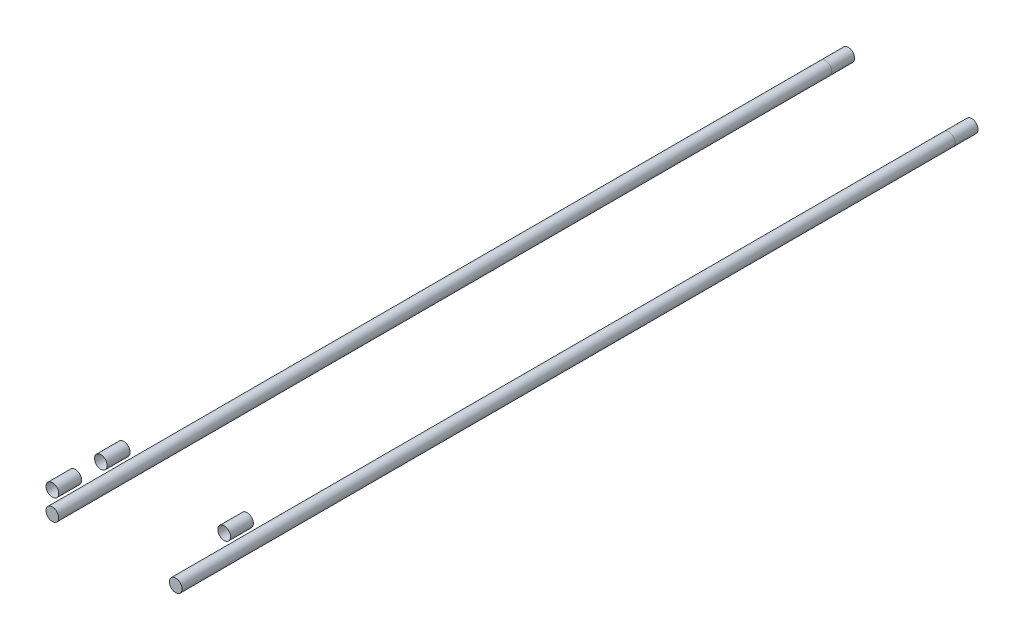
ISO-10303-21;
HEADER;
FILE_DESCRIPTION(('STEP AP214'),'2;1');
FILE_NAME('part.step','',(''),(''),'','','');
FILE_SCHEMA(('AUTOMOTIVE_DESIGN { 1 0 10303 214 1 1 1 1 }'));
ENDSEC;
DATA;
#1=APPLICATION_CONTEXT('core data for automotive mechanical design processes');
#2=APPLICATION_PROTOCOL_DEFINITION('international standard','automotive_design',2000,#1);
#3=PRODUCT_CONTEXT('',#1,'mechanical');
#4=PRODUCT('Part','Part','',(#3));
#5=PRODUCT_RELATED_PRODUCT_CATEGORY('part','',(#4));
#6=PRODUCT_DEFINITION_FORMATION('','',#4);
#7=PRODUCT_DEFINITION_CONTEXT('part definition',#1,'design');
#8=PRODUCT_DEFINITION('design','',#6,#7);
#9=PRODUCT_DEFINITION_SHAPE('','',#8);
#10=(LENGTH_UNIT() NAMED_UNIT(*) SI_UNIT(.MILLI.,.METRE.));
#11=(NAMED_UNIT(*) PLANE_ANGLE_UNIT() SI_UNIT($,.RADIAN.));
#12=(NAMED_UNIT(*) SI_UNIT($,.STERADIAN.) SOLID_ANGLE_UNIT());
#13=UNCERTAINTY_MEASURE_WITH_UNIT(LENGTH_MEASURE(1.E-05),#10,'distance_accuracy_value','');
#14=(GEOMETRIC_REPRESENTATION_CONTEXT(3) GLOBAL_UNCERTAINTY_ASSIGNED_CONTEXT((#13)) GLOBAL_UNIT_ASSIGNED_CONTEXT((#10,
#11,#12)) REPRESENTATION_CONTEXT('',''));
#15=CARTESIAN_POINT('',(0.,0.,0.));
#16=DIRECTION('',(0.,0.,1.));
#17=DIRECTION('',(1.,0.,0.));
#18=AXIS2_PLACEMENT_3D('',#15,#16,#17);
#19=CARTESIAN_POINT('',(86.868,-20.93468,66.2586122421384));
#20=DIRECTION('',(0.,0.,-1.));
#21=DIRECTION('',(-1.,0.,0.));
#22=AXIS2_PLACEMENT_3D('',#19,#20,#21);
#23=CYLINDRICAL_SURFACE('',#22,6.35);
#24=CARTESIAN_POINT('',(86.868,-20.93468,-722.376));
#25=DIRECTION('',(0.,0.,1.));
#26=DIRECTION('',(1.,0.,0.));
#27=AXIS2_PLACEMENT_3D('',#24,#25,#26);
#28=CIRCLE('',#27,6.35);
#29=CARTESIAN_POINT('',(80.518,-20.93468,-722.376));
#30=VERTEX_POINT('',#29);
#31=EDGE_CURVE('E51',#30,#30,#28,.T.);
#32=CARTESIAN_POINT('',(86.868,-20.93468,48.2981000000001));
#33=DIRECTION('',(0.,0.,1.));
#34=DIRECTION('',(1.,0.,0.));
#35=AXIS2_PLACEMENT_3D('',#32,#33,#34);
#36=CIRCLE('',#35,6.35);
#37=CARTESIAN_POINT('',(80.518,-20.93468,48.2981000000001));
#38=VERTEX_POINT('',#37);
#39=EDGE_CURVE('E11',#38,#38,#36,.T.);
#40=CARTESIAN_POINT('',(80.518,-20.93468,-722.376));
#41=CARTESIAN_POINT('',(80.518,-20.93468,-714.348144791667));
#42=CARTESIAN_POINT('',(80.518,-20.93468,-706.320289583333));
#43=CARTESIAN_POINT('',(80.518,-20.93468,-690.264579166667));
#44=CARTESIAN_POINT('',(80.518,-20.93468,-682.236723958333));
#45=CARTESIAN_POINT('',(80.518,-20.93468,-666.181013541667));
#46=CARTESIAN_POINT('',(80.518,-20.93468,-658.153158333333));
#47=CARTESIAN_POINT('',(80.518,-20.93468,-642.097447916667));
#48=CARTESIAN_POINT('',(80.518,-20.93468,-634.069592708333));
#49=CARTESIAN_POINT('',(80.518,-20.93468,-618.013882291667));
#50=CARTESIAN_POINT('',(80.518,-20.93468,-609.986027083333));
#51=CARTESIAN_POINT('',(80.518,-20.93468,-593.930316666666));
#52=CARTESIAN_POINT('',(80.518,-20.93468,-585.902461458333));
#53=CARTESIAN_POINT('',(80.518,-20.93468,-569.846751041666));
#54=CARTESIAN_POINT('',(80.518,-20.93468,-561.818895833333));
#55=CARTESIAN_POINT('',(80.518,-20.93468,-545.763185416667));
#56=CARTESIAN_POINT('',(80.518,-20.93468,-537.735330208333));
#57=CARTESIAN_POINT('',(80.518,-20.93468,-521.679619791667));
#58=CARTESIAN_POINT('',(80.518,-20.93468,-513.651764583333));
#59=CARTESIAN_POINT('',(80.518,-20.93468,-497.596054166667));
#60=CARTESIAN_POINT('',(80.518,-20.93468,-489.568198958333));
#61=CARTESIAN_POINT('',(80.518,-20.93468,-473.512488541667));
#62=CARTESIAN_POINT('',(80.518,-20.93468,-465.484633333333));
#63=CARTESIAN_POINT('',(80.518,-20.93468,-449.428922916667));
#64=CARTESIAN_POINT('',(80.518,-20.93468,-441.401067708333));
#65=CARTESIAN_POINT('',(80.518,-20.93468,-425.345357291667));
#66=CARTESIAN_POINT('',(80.518,-20.93468,-417.317502083333));
#67=CARTESIAN_POINT('',(80.518,-20.93468,-401.261791666667));
#68=CARTESIAN_POINT('',(80.518,-20.93468,-393.233936458333));
#69=CARTESIAN_POINT('',(80.518,-20.93468,-377.178226041667));
#70=CARTESIAN_POINT('',(80.518,-20.93468,-369.150370833333));
#71=CARTESIAN_POINT('',(80.518,-20.93468,-353.094660416667));
#72=CARTESIAN_POINT('',(80.518,-20.93468,-345.066805208333));
#73=CARTESIAN_POINT('',(80.518,-20.93468,-329.011094791667));
#74=CARTESIAN_POINT('',(80.518,-20.93468,-320.983239583333));
#75=CARTESIAN_POINT('',(80.518,-20.93468,-304.927529166667));
#76=CARTESIAN_POINT('',(80.518,-20.93468,-296.899673958333));
#77=CARTESIAN_POINT('',(80.518,-20.93468,-280.843963541667));
#78=CARTESIAN_POINT('',(80.518,-20.93468,-272.816108333333));
#79=CARTESIAN_POINT('',(80.518,-20.93468,-256.760397916667));
#80=CARTESIAN_POINT('',(80.518,-20.93468,-248.732542708333));
#81=CARTESIAN_POINT('',(80.518,-20.93468,-232.676832291667));
#82=CARTESIAN_POINT('',(80.518,-20.93468,-224.648977083333));
#83=CARTESIAN_POINT('',(80.518,-20.93468,-208.593266666667));
#84=CARTESIAN_POINT('',(80.518,-20.93468,-200.565411458333));
#85=CARTESIAN_POINT('',(80.518,-20.93468,-184.509701041667));
#86=CARTESIAN_POINT('',(80.518,-20.93468,-176.481845833333));
#87=CARTESIAN_POINT('',(80.518,-20.93468,-160.426135416667));
#88=CARTESIAN_POINT('',(80.518,-20.93468,-152.398280208333));
#89=CARTESIAN_POINT('',(80.518,-20.93468,-136.342569791667));
#90=CARTESIAN_POINT('',(80.518,-20.93468,-128.314714583333));
#91=CARTESIAN_POINT('',(80.518,-20.93468,-112.259004166667));
#92=CARTESIAN_POINT('',(80.518,-20.93468,-104.231148958333));
#93=CARTESIAN_POINT('',(80.518,-20.93468,-88.1754385416666));
#94=CARTESIAN_POINT('',(80.518,-20.93468,-80.1475833333332));
#95=CARTESIAN_POINT('',(80.518,-20.93468,-64.0918729166665));
#96=CARTESIAN_POINT('',(80.518,-20.93468,-56.0640177083332));
#97=CARTESIAN_POINT('',(80.518,-20.93468,-40.0083072916665));
#98=CARTESIAN_POINT('',(80.518,-20.93468,-31.9804520833332));
#99=CARTESIAN_POINT('',(80.518,-20.93468,-15.9247416666665));
#100=CARTESIAN_POINT('',(80.518,-20.93468,-7.89688645833322));
#101=CARTESIAN_POINT('',(80.518,-20.93468,8.15882395833342));
#102=CARTESIAN_POINT('',(80.518,-20.93468,16.1866791666668));
#103=CARTESIAN_POINT('',(80.518,-20.93468,32.2423895833334));
#104=CARTESIAN_POINT('',(80.518,-20.93468,40.2702447916668));
#105=CARTESIAN_POINT('',(80.518,-20.93468,48.2981000000001));
#106=B_SPLINE_CURVE_WITH_KNOTS('',3,(#40,#41,#42,#43,#44,#45,#46,#47,#48,#49,#50,#51,#52,#53,
#54,#55,#56,#57,#58,#59,#60,#61,#62,#63,#64,#65,#66,#67,#68,#69,#70,#71,#72,#73,#74,#75,#76,#77,
#78,#79,#80,#81,#82,#83,#84,#85,#86,#87,#88,#89,#90,#91,#92,#93,#94,#95,#96,#97,#98,#99,#100,
#101,#102,#103,#104,#105),.UNSPECIFIED.,.F.,.F.,(4,2,2,2,2,2,2,2,2,2,2,2,2,2,2,2,2,2,2,2,2,2,2,
2,2,2,2,2,2,2,2,2,4),(0.,24.083565625,48.1671312500001,72.2506968750001,96.3342625,
120.417828125,144.50139375,168.584959375,192.668525,216.752090625,240.83565625,264.919221875,
289.0027875,313.086353125,337.16991875,361.253484375,385.33705,409.420615625,433.50418125,
457.587746875,481.6713125,505.754878125,529.83844375,553.922009375,578.005575,602.089140625,
626.17270625,650.256271875,674.3398375,698.423403125,722.50696875,746.590534375,770.6741),.UNSPECIFIED.);
#107=EDGE_CURVE('BSEAM44',#30,#38,#106,.T.);
#108=ORIENTED_EDGE('',*,*,#31,.T.);
#109=ORIENTED_EDGE('',*,*,#39,.F.);
#110=ORIENTED_EDGE('',*,*,#107,.T.);
#111=ORIENTED_EDGE('',*,*,#107,.F.);
#112=EDGE_LOOP('',(#108,#110,#109,#111));
#113=FACE_BOUND('',#112,.T.);
#114=ADVANCED_FACE('F44',(#113),#23,.T.);
#115=CARTESIAN_POINT('',(86.868,-20.93468,-722.376));
#116=DIRECTION('',(0.,0.,1.));
#117=DIRECTION('',(1.,0.,0.));
#118=AXIS2_PLACEMENT_3D('',#115,#116,#117);
#119=PLANE('',#118);
#120=ORIENTED_EDGE('',*,*,#31,.F.);
#121=EDGE_LOOP('',(#120));
#122=FACE_BOUND('',#121,.T.);
#123=ADVANCED_FACE('F59',(#122),#119,.F.);
#124=CARTESIAN_POINT('',(0.,0.,48.2981000000001));
#125=DIRECTION('',(0.,0.,1.));
#126=DIRECTION('',(1.,0.,0.));
#127=AXIS2_PLACEMENT_3D('',#124,#125,#126);
#128=PLANE('',#127);
#129=ORIENTED_EDGE('',*,*,#39,.T.);
#130=EDGE_LOOP('',(#129));
#131=FACE_BOUND('',#130,.T.);
#132=ADVANCED_FACE('F46',(#131),#128,.T.);
#133=CLOSED_SHELL('',(#114,#123,#132));
#134=MANIFOLD_SOLID_BREP('B2',#133);
#135=CARTESIAN_POINT('',(-36.0680000000002,-20.93468,66.2586122421384));
#136=DIRECTION('',(0.,0.,-1.));
#137=DIRECTION('',(-1.,0.,0.));
#138=AXIS2_PLACEMENT_3D('',#135,#136,#137);
#139=CYLINDRICAL_SURFACE('',#138,6.35);
#140=CARTESIAN_POINT('',(-36.0680000000002,-20.93468,-722.376));
#141=DIRECTION('',(0.,0.,1.));
#142=DIRECTION('',(1.,0.,0.));
#143=AXIS2_PLACEMENT_3D('',#140,#141,#142);
#144=CIRCLE('',#143,6.35);
#145=CARTESIAN_POINT('',(-42.4180000000002,-20.93468,-722.376));
#146=VERTEX_POINT('',#145);
#147=EDGE_CURVE('E100',#146,#146,#144,.T.);
#148=CARTESIAN_POINT('',(-36.0680000000002,-20.93468,48.2981000000001));
#149=DIRECTION('',(0.,0.,1.));
#150=DIRECTION('',(1.,0.,0.));
#151=AXIS2_PLACEMENT_3D('',#148,#149,#150);
#152=CIRCLE('',#151,6.35);
#153=CARTESIAN_POINT('',(-42.4180000000002,-20.93468,48.2981000000001));
#154=VERTEX_POINT('',#153);
#155=EDGE_CURVE('E43',#154,#154,#152,.T.);
#156=CARTESIAN_POINT('',(-42.4180000000002,-20.93468,-722.376));
#157=CARTESIAN_POINT('',(-42.4180000000002,-20.93468,-714.348144791667));
#158=CARTESIAN_POINT('',(-42.4180000000002,-20.93468,-706.320289583333));
#159=CARTESIAN_POINT('',(-42.4180000000002,-20.93468,-690.264579166667));
#160=CARTESIAN_POINT('',(-42.4180000000002,-20.93468,-682.236723958333));
#161=CARTESIAN_POINT('',(-42.4180000000002,-20.93468,-666.181013541667));
#162=CARTESIAN_POINT('',(-42.4180000000002,-20.93468,-658.153158333333));
#163=CARTESIAN_POINT('',(-42.4180000000002,-20.93468,-642.097447916667));
#164=CARTESIAN_POINT('',(-42.4180000000002,-20.93468,-634.069592708333));
#165=CARTESIAN_POINT('',(-42.4180000000002,-20.93468,-618.013882291667));
#166=CARTESIAN_POINT('',(-42.4180000000002,-20.93468,-609.986027083333));
#167=CARTESIAN_POINT('',(-42.4180000000002,-20.93468,-593.930316666666));
#168=CARTESIAN_POINT('',(-42.4180000000002,-20.93468,-585.902461458333));
#169=CARTESIAN_POINT('',(-42.4180000000002,-20.93468,-569.846751041666));
#170=CARTESIAN_POINT('',(-42.4180000000002,-20.93468,-561.818895833333));
#171=CARTESIAN_POINT('',(-42.4180000000002,-20.93468,-545.763185416667));
#172=CARTESIAN_POINT('',(-42.4180000000002,-20.93468,-537.735330208333));
#173=CARTESIAN_POINT('',(-42.4180000000002,-20.93468,-521.679619791667));
#174=CARTESIAN_POINT('',(-42.4180000000002,-20.93468,-513.651764583333));
#175=CARTESIAN_POINT('',(-42.4180000000002,-20.93468,-497.596054166667));
#176=CARTESIAN_POINT('',(-42.4180000000002,-20.93468,-489.568198958333));
#177=CARTESIAN_POINT('',(-42.4180000000002,-20.93468,-473.512488541667));
#178=CARTESIAN_POINT('',(-42.4180000000002,-20.93468,-465.484633333333));
#179=CARTESIAN_POINT('',(-42.4180000000002,-20.93468,-449.428922916667));
#180=CARTESIAN_POINT('',(-42.4180000000002,-20.93468,-441.401067708333));
#181=CARTESIAN_POINT('',(-42.4180000000002,-20.93468,-425.345357291667));
#182=CARTESIAN_POINT('',(-42.4180000000002,-20.93468,-417.317502083333));
#183=CARTESIAN_POINT('',(-42.4180000000002,-20.93468,-401.261791666667));
#184=CARTESIAN_POINT('',(-42.4180000000002,-20.93468,-393.233936458333));
#185=CARTESIAN_POINT('',(-42.4180000000002,-20.93468,-377.178226041667));
#186=CARTESIAN_POINT('',(-42.4180000000002,-20.93468,-369.150370833333));
#187=CARTESIAN_POINT('',(-42.4180000000002,-20.93468,-353.094660416667));
#188=CARTESIAN_POINT('',(-42.4180000000002,-20.93468,-345.066805208333));
#189=CARTESIAN_POINT('',(-42.4180000000002,-20.93468,-329.011094791667));
#190=CARTESIAN_POINT('',(-42.4180000000002,-20.93468,-320.983239583333));
#191=CARTESIAN_POINT('',(-42.4180000000002,-20.93468,-304.927529166667));
#192=CARTESIAN_POINT('',(-42.4180000000002,-20.93468,-296.899673958333));
#193=CARTESIAN_POINT('',(-42.4180000000002,-20.93468,-280.843963541667));
#194=CARTESIAN_POINT('',(-42.4180000000002,-20.93468,-272.816108333333));
#195=CARTESIAN_POINT('',(-42.4180000000002,-20.93468,-256.760397916667));
#196=CARTESIAN_POINT('',(-42.4180000000002,-20.93468,-248.732542708333));
#197=CARTESIAN_POINT('',(-42.4180000000002,-20.93468,-232.676832291667));
#198=CARTESIAN_POINT('',(-42.4180000000002,-20.93468,-224.648977083333));
#199=CARTESIAN_POINT('',(-42.4180000000002,-20.93468,-208.593266666667));
#200=CARTESIAN_POINT('',(-42.4180000000002,-20.93468,-200.565411458333));
#201=CARTESIAN_POINT('',(-42.4180000000002,-20.93468,-184.509701041667));
#202=CARTESIAN_POINT('',(-42.4180000000002,-20.93468,-176.481845833333));
#203=CARTESIAN_POINT('',(-42.4180000000002,-20.93468,-160.426135416667));
#204=CARTESIAN_POINT('',(-42.4180000000002,-20.93468,-152.398280208333));
#205=CARTESIAN_POINT('',(-42.4180000000002,-20.93468,-136.342569791667));
#206=CARTESIAN_POINT('',(-42.4180000000002,-20.93468,-128.314714583333));
#207=CARTESIAN_POINT('',(-42.4180000000002,-20.93468,-112.259004166667));
#208=CARTESIAN_POINT('',(-42.4180000000002,-20.93468,-104.231148958333));
#209=CARTESIAN_POINT('',(-42.4180000000002,-20.93468,-88.1754385416666));
#210=CARTESIAN_POINT('',(-42.4180000000002,-20.93468,-80.1475833333332));
#211=CARTESIAN_POINT('',(-42.4180000000002,-20.93468,-64.0918729166665));
#212=CARTESIAN_POINT('',(-42.4180000000002,-20.93468,-56.0640177083332));
#213=CARTESIAN_POINT('',(-42.4180000000002,-20.93468,-40.0083072916665));
#214=CARTESIAN_POINT('',(-42.4180000000002,-20.93468,-31.9804520833332));
#215=CARTESIAN_POINT('',(-42.4180000000002,-20.93468,-15.9247416666665));
#216=CARTESIAN_POINT('',(-42.4180000000002,-20.93468,-7.89688645833322));
#217=CARTESIAN_POINT('',(-42.4180000000002,-20.93468,8.15882395833342));
#218=CARTESIAN_POINT('',(-42.4180000000002,-20.93468,16.1866791666668));
#219=CARTESIAN_POINT('',(-42.4180000000002,-20.93468,32.2423895833334));
#220=CARTESIAN_POINT('',(-42.4180000000002,-20.93468,40.2702447916668));
#221=CARTESIAN_POINT('',(-42.4180000000002,-20.93468,48.2981000000001));
#222=B_SPLINE_CURVE_WITH_KNOTS('',3,(#156,#157,#158,#159,#160,#161,#162,#163,#164,#165,#166,
#167,#168,#169,#170,#171,#172,#173,#174,#175,#176,#177,#178,#179,#180,#181,#182,#183,#184,#185,
#186,#187,#188,#189,#190,#191,#192,#193,#194,#195,#196,#197,#198,#199,#200,#201,#202,#203,#204,
#205,#206,#207,#208,#209,#210,#211,#212,#213,#214,#215,#216,#217,#218,#219,#220,#221),
.UNSPECIFIED.,.F.,.F.,(4,2,2,2,2,2,2,2,2,2,2,2,2,2,2,2,2,2,2,2,2,2,2,2,2,2,2,2,2,2,2,2,4),(0.,
24.083565625,48.1671312500001,72.2506968750001,96.3342625,120.417828125,144.50139375,
168.584959375,192.668525,216.752090625,240.83565625,264.919221875,289.0027875,313.086353125,
337.16991875,361.253484375,385.33705,409.420615625,433.50418125,457.587746875,481.6713125,
505.754878125,529.83844375,553.922009375,578.005575,602.089140625,626.17270625,650.256271875,
674.3398375,698.423403125,722.50696875,746.590534375,770.6741),.UNSPECIFIED.);
#223=EDGE_CURVE('BSEAM93',#146,#154,#222,.T.);
#224=ORIENTED_EDGE('',*,*,#147,.T.);
#225=ORIENTED_EDGE('',*,*,#155,.F.);
#226=ORIENTED_EDGE('',*,*,#223,.T.);
#227=ORIENTED_EDGE('',*,*,#223,.F.);
#228=EDGE_LOOP('',(#224,#226,#225,#227));
#229=FACE_BOUND('',#228,.T.);
#230=ADVANCED_FACE('F93',(#229),#139,.T.);
#231=CARTESIAN_POINT('',(-36.0680000000002,-20.93468,-722.376));
#232=DIRECTION('',(0.,0.,1.));
#233=DIRECTION('',(1.,0.,0.));
#234=AXIS2_PLACEMENT_3D('',#231,#232,#233);
#235=PLANE('',#234);
#236=ORIENTED_EDGE('',*,*,#147,.F.);
#237=EDGE_LOOP('',(#236));
#238=FACE_BOUND('',#237,.T.);
#239=ADVANCED_FACE('F108',(#238),#235,.F.);
#240=CARTESIAN_POINT('',(0.,0.,48.2981000000001));
#241=DIRECTION('',(0.,0.,1.));
#242=DIRECTION('',(1.,0.,0.));
#243=AXIS2_PLACEMENT_3D('',#240,#241,#242);
#244=PLANE('',#243);
#245=ORIENTED_EDGE('',*,*,#155,.T.);
#246=EDGE_LOOP('',(#245));
#247=FACE_BOUND('',#246,.T.);
#248=ADVANCED_FACE('F95',(#247),#244,.T.);
#249=CLOSED_SHELL('',(#230,#239,#248));
#250=MANIFOLD_SOLID_BREP('B6',#249);
#251=CARTESIAN_POINT('',(-36.068,0.,36.8681000000001));
#252=DIRECTION('',(0.,0.,1.));
#253=DIRECTION('',(0.757966435656567,-0.652293555401308,0.));
#254=AXIS2_PLACEMENT_3D('',#251,#252,#253);
#255=CYLINDRICAL_SURFACE('',#254,6.35);
#256=CARTESIAN_POINT('',(-36.068,0.,48.2981000000001));
#257=DIRECTION('',(0.,0.,1.));
#258=DIRECTION('',(0.757966435656567,-0.652293555401308,0.));
#259=AXIS2_PLACEMENT_3D('',#256,#257,#258);
#260=CIRCLE('',#259,6.35);
#261=CARTESIAN_POINT('',(-31.2549131335808,-4.1420640767983,48.2981000000001));
#262=VERTEX_POINT('',#261);
#263=EDGE_CURVE('E146',#262,#262,#260,.F.);
#264=ORIENTED_EDGE('',*,*,#263,.F.);
#265=EDGE_LOOP('',(#264));
#266=FACE_BOUND('',#265,.T.);
#267=CARTESIAN_POINT('',(-36.068,0.,25.4381000000001));
#268=DIRECTION('',(0.,0.,1.));
#269=DIRECTION('',(0.757966435656567,-0.652293555401308,0.));
#270=AXIS2_PLACEMENT_3D('',#267,#268,#269);
#271=CIRCLE('',#270,6.35);
#272=CARTESIAN_POINT('',(-31.2549131335808,-4.14206407679831,25.4381000000001));
#273=VERTEX_POINT('',#272);
#274=EDGE_CURVE('E92',#273,#273,#271,.T.);
#275=ORIENTED_EDGE('',*,*,#274,.F.);
#276=EDGE_LOOP('',(#275));
#277=FACE_BOUND('',#276,.T.);
#278=ADVANCED_FACE('F142',(#266,#277),#255,.F.);
#279=OPEN_SHELL('',(#278));
#280=SHELL_BASED_SURFACE_MODEL('B38',(#279));
#281=CARTESIAN_POINT('',(-36.068,0.,36.8681000000001));
#282=DIRECTION('',(0.,0.,1.));
#283=DIRECTION('',(0.757966435656567,-0.652293555401308,0.));
#284=AXIS2_PLACEMENT_3D('',#281,#282,#283);
#285=CYLINDRICAL_SURFACE('',#284,6.35);
#286=CARTESIAN_POINT('',(-36.068,0.,48.2981000000001));
#287=DIRECTION('',(0.,0.,1.));
#288=DIRECTION('',(0.757966435656567,-0.652293555401308,0.));
#289=AXIS2_PLACEMENT_3D('',#286,#287,#288);
#290=CIRCLE('',#289,6.35);
#291=CARTESIAN_POINT('',(-31.2549131335808,-4.1420640767983,48.2981000000001));
#292=VERTEX_POINT('',#291);
#293=EDGE_CURVE('E191',#292,#292,#290,.F.);
#294=ORIENTED_EDGE('',*,*,#293,.F.);
#295=EDGE_LOOP('',(#294));
#296=FACE_BOUND('',#295,.T.);
#297=CARTESIAN_POINT('',(-36.068,0.,25.4381000000001));
#298=DIRECTION('',(0.,0.,1.));
#299=DIRECTION('',(0.757966435656567,-0.652293555401308,0.));
#300=AXIS2_PLACEMENT_3D('',#297,#298,#299);
#301=CIRCLE('',#300,6.35);
#302=CARTESIAN_POINT('',(-31.2549131335808,-4.14206407679831,25.4381000000001));
#303=VERTEX_POINT('',#302);
#304=EDGE_CURVE('E141',#303,#303,#301,.T.);
#305=ORIENTED_EDGE('',*,*,#304,.F.);
#306=EDGE_LOOP('',(#305));
#307=FACE_BOUND('',#306,.T.);
#308=ADVANCED_FACE('F187',(#296,#307),#285,.F.);
#309=OPEN_SHELL('',(#308));
#310=SHELL_BASED_SURFACE_MODEL('B87',(#309));
#311=CARTESIAN_POINT('',(86.868,-20.93468,-733.806));
#312=DIRECTION('',(0.,0.,1.));
#313=DIRECTION('',(-1.,0.,0.));
#314=AXIS2_PLACEMENT_3D('',#311,#312,#313);
#315=CYLINDRICAL_SURFACE('',#314,6.35);
#316=CARTESIAN_POINT('',(86.868,-20.93468,-745.236));
#317=DIRECTION('',(0.,0.,1.));
#318=DIRECTION('',(-1.,0.,0.));
#319=AXIS2_PLACEMENT_3D('',#316,#317,#318);
#320=CIRCLE('',#319,6.35);
#321=CARTESIAN_POINT('',(80.518,-20.93468,-745.236));
#322=VERTEX_POINT('',#321);
#323=EDGE_CURVE('E236',#322,#322,#320,.T.);
#324=ORIENTED_EDGE('',*,*,#323,.F.);
#325=EDGE_LOOP('',(#324));
#326=FACE_BOUND('',#325,.T.);
#327=CARTESIAN_POINT('',(86.868,-20.93468,-722.376));
#328=DIRECTION('',(0.,0.,1.));
#329=DIRECTION('',(-1.,0.,0.));
#330=AXIS2_PLACEMENT_3D('',#327,#328,#329);
#331=CIRCLE('',#330,6.35);
#332=CARTESIAN_POINT('',(80.518,-20.93468,-722.376));
#333=VERTEX_POINT('',#332);
#334=EDGE_CURVE('E186',#333,#333,#331,.F.);
#335=ORIENTED_EDGE('',*,*,#334,.F.);
#336=EDGE_LOOP('',(#335));
#337=FACE_BOUND('',#336,.T.);
#338=ADVANCED_FACE('F232',(#326,#337),#315,.F.);
#339=OPEN_SHELL('',(#338));
#340=SHELL_BASED_SURFACE_MODEL('B136',(#339));
#341=CARTESIAN_POINT('',(-36.0680000000002,-20.93468,-733.806));
#342=DIRECTION('',(0.,0.,1.));
#343=DIRECTION('',(-1.,0.,0.));
#344=AXIS2_PLACEMENT_3D('',#341,#342,#343);
#345=CYLINDRICAL_SURFACE('',#344,6.35);
#346=CARTESIAN_POINT('',(-36.0680000000002,-20.93468,-745.236));
#347=DIRECTION('',(0.,0.,1.));
#348=DIRECTION('',(-1.,0.,0.));
#349=AXIS2_PLACEMENT_3D('',#346,#347,#348);
#350=CIRCLE('',#349,6.35);
#351=CARTESIAN_POINT('',(-42.4180000000002,-20.93468,-745.236));
#352=VERTEX_POINT('',#351);
#353=EDGE_CURVE('E269',#352,#352,#350,.T.);
#354=ORIENTED_EDGE('',*,*,#353,.F.);
#355=EDGE_LOOP('',(#354));
#356=FACE_BOUND('',#355,.T.);
#357=CARTESIAN_POINT('',(-36.0680000000002,-20.93468,-722.376));
#358=DIRECTION('',(0.,0.,1.));
#359=DIRECTION('',(-1.,0.,0.));
#360=AXIS2_PLACEMENT_3D('',#357,#358,#359);
#361=CIRCLE('',#360,6.35);
#362=CARTESIAN_POINT('',(-42.4180000000002,-20.93468,-722.376));
#363=VERTEX_POINT('',#362);
#364=EDGE_CURVE('E231',#363,#363,#361,.F.);
#365=ORIENTED_EDGE('',*,*,#364,.F.);
#366=EDGE_LOOP('',(#365));
#367=FACE_BOUND('',#366,.T.);
#368=ADVANCED_FACE('F265',(#356,#367),#345,.F.);
#369=OPEN_SHELL('',(#368));
#370=SHELL_BASED_SURFACE_MODEL('B181',(#369));
#371=CARTESIAN_POINT('',(-36.068,0.,36.8681000000001));
#372=DIRECTION('',(0.,0.,1.));
#373=DIRECTION('',(0.757966435656567,-0.652293555401308,0.));
#374=AXIS2_PLACEMENT_3D('',#371,#372,#373);
#375=CYLINDRICAL_SURFACE('',#374,6.35);
#376=CARTESIAN_POINT('',(-36.068,0.,48.2981000000001));
#377=DIRECTION('',(0.,0.,1.));
#378=DIRECTION('',(0.757966435656567,-0.652293555401308,0.));
#379=AXIS2_PLACEMENT_3D('',#376,#377,#378);
#380=CIRCLE('',#379,6.35);
#381=CARTESIAN_POINT('',(-31.2549131335808,-4.1420640767983,48.2981000000001));
#382=VERTEX_POINT('',#381);
#383=EDGE_CURVE('E302',#382,#382,#380,.F.);
#384=ORIENTED_EDGE('',*,*,#383,.F.);
#385=EDGE_LOOP('',(#384));
#386=FACE_BOUND('',#385,.T.);
#387=CARTESIAN_POINT('',(-36.068,0.,25.4381000000001));
#388=DIRECTION('',(0.,0.,1.));
#389=DIRECTION('',(0.757966435656567,-0.652293555401308,0.));
#390=AXIS2_PLACEMENT_3D('',#387,#388,#389);
#391=CIRCLE('',#390,6.35);
#392=CARTESIAN_POINT('',(-31.2549131335808,-4.14206407679831,25.4381000000001));
#393=VERTEX_POINT('',#392);
#394=EDGE_CURVE('E264',#393,#393,#391,.T.);
#395=ORIENTED_EDGE('',*,*,#394,.F.);
#396=EDGE_LOOP('',(#395));
#397=FACE_BOUND('',#396,.T.);
#398=ADVANCED_FACE('F298',(#386,#397),#375,.F.);
#399=OPEN_SHELL('',(#398));
#400=SHELL_BASED_SURFACE_MODEL('B226',(#399));
#401=CARTESIAN_POINT('',(-36.068,0.,36.8681000000001));
#402=DIRECTION('',(0.,0.,1.));
#403=DIRECTION('',(0.757966435656567,-0.652293555401308,0.));
#404=AXIS2_PLACEMENT_3D('',#401,#402,#403);
#405=CYLINDRICAL_SURFACE('',#404,6.35);
#406=CARTESIAN_POINT('',(-36.068,0.,48.2981000000001));
#407=DIRECTION('',(0.,0.,1.));
#408=DIRECTION('',(0.757966435656567,-0.652293555401308,0.));
#409=AXIS2_PLACEMENT_3D('',#406,#407,#408);
#410=CIRCLE('',#409,6.35);
#411=CARTESIAN_POINT('',(-31.2549131335808,-4.1420640767983,48.2981000000001));
#412=VERTEX_POINT('',#411);
#413=EDGE_CURVE('E347',#412,#412,#410,.F.);
#414=ORIENTED_EDGE('',*,*,#413,.F.);
#415=EDGE_LOOP('',(#414));
#416=FACE_BOUND('',#415,.T.);
#417=CARTESIAN_POINT('',(-36.068,0.,25.4381000000001));
#418=DIRECTION('',(0.,0.,1.));
#419=DIRECTION('',(0.757966435656567,-0.652293555401308,0.));
#420=AXIS2_PLACEMENT_3D('',#417,#418,#419);
#421=CIRCLE('',#420,6.35);
#422=CARTESIAN_POINT('',(-31.2549131335808,-4.14206407679831,25.4381000000001));
#423=VERTEX_POINT('',#422);
#424=EDGE_CURVE('E297',#423,#423,#421,.T.);
#425=ORIENTED_EDGE('',*,*,#424,.F.);
#426=EDGE_LOOP('',(#425));
#427=FACE_BOUND('',#426,.T.);
#428=ADVANCED_FACE('F343',(#416,#427),#405,.F.);
#429=OPEN_SHELL('',(#428));
#430=SHELL_BASED_SURFACE_MODEL('B259',(#429));
#431=CARTESIAN_POINT('',(86.868,0.,-11.4300000000001));
#432=DIRECTION('',(0.,0.,-1.));
#433=DIRECTION('',(-1.,0.,0.));
#434=AXIS2_PLACEMENT_3D('',#431,#432,#433);
#435=CYLINDRICAL_SURFACE('',#434,6.35);
#436=CARTESIAN_POINT('',(86.868,0.,0.));
#437=DIRECTION('',(0.,0.,-1.));
#438=DIRECTION('',(-1.,0.,0.));
#439=AXIS2_PLACEMENT_3D('',#436,#437,#438);
#440=CIRCLE('',#439,6.35);
#441=CARTESIAN_POINT('',(80.518,0.,0.));
#442=VERTEX_POINT('',#441);
#443=EDGE_CURVE('E391',#442,#442,#440,.T.);
#444=ORIENTED_EDGE('',*,*,#443,.F.);
#445=EDGE_LOOP('',(#444));
#446=FACE_BOUND('',#445,.T.);
#447=CARTESIAN_POINT('',(86.868,0.,-22.8600000000001));
#448=DIRECTION('',(0.,0.,-1.));
#449=DIRECTION('',(-1.,0.,0.));
#450=AXIS2_PLACEMENT_3D('',#447,#448,#449);
#451=CIRCLE('',#450,6.35);
#452=CARTESIAN_POINT('',(80.518,0.,-22.8600000000001));
#453=VERTEX_POINT('',#452);
#454=EDGE_CURVE('E342',#453,#453,#451,.F.);
#455=ORIENTED_EDGE('',*,*,#454,.F.);
#456=EDGE_LOOP('',(#455));
#457=FACE_BOUND('',#456,.T.);
#458=ADVANCED_FACE('F387',(#446,#457),#435,.F.);
#459=OPEN_SHELL('',(#458));
#460=SHELL_BASED_SURFACE_MODEL('B292',(#459));
#461=CARTESIAN_POINT('',(-36.068,0.,-11.43));
#462=DIRECTION('',(0.,0.,-1.));
#463=DIRECTION('',(-1.,0.,0.));
#464=AXIS2_PLACEMENT_3D('',#461,#462,#463);
#465=CYLINDRICAL_SURFACE('',#464,6.35);
#466=CARTESIAN_POINT('',(-36.068,0.,0.));
#467=DIRECTION('',(0.,0.,-1.));
#468=DIRECTION('',(-1.,0.,0.));
#469=AXIS2_PLACEMENT_3D('',#466,#467,#468);
#470=CIRCLE('',#469,6.35);
#471=CARTESIAN_POINT('',(-42.418,0.,0.));
#472=VERTEX_POINT('',#471);
#473=EDGE_CURVE('E416',#472,#472,#470,.T.);
#474=ORIENTED_EDGE('',*,*,#473,.F.);
#475=EDGE_LOOP('',(#474));
#476=FACE_BOUND('',#475,.T.);
#477=CARTESIAN_POINT('',(-36.068,0.,-22.86));
#478=DIRECTION('',(0.,0.,-1.));
#479=DIRECTION('',(-1.,0.,0.));
#480=AXIS2_PLACEMENT_3D('',#477,#478,#479);
#481=CIRCLE('',#480,6.35);
#482=CARTESIAN_POINT('',(-42.418,0.,-22.86));
#483=VERTEX_POINT('',#482);
#484=EDGE_CURVE('E386',#483,#483,#481,.F.);
#485=ORIENTED_EDGE('',*,*,#484,.F.);
#486=EDGE_LOOP('',(#485));
#487=FACE_BOUND('',#486,.T.);
#488=ADVANCED_FACE('F412',(#476,#487),#465,.F.);
#489=OPEN_SHELL('',(#488));
#490=SHELL_BASED_SURFACE_MODEL('B337',(#489));
#491=ADVANCED_BREP_SHAPE_REPRESENTATION('',(#18,#134,#250),#14);
#492=MANIFOLD_SURFACE_SHAPE_REPRESENTATION('',(#18,#280,#310,#340,#370,#400,#430,#460,#490),#14);
#493=SHAPE_REPRESENTATION('',(#18),#14);
#494=SHAPE_DEFINITION_REPRESENTATION(#9,#493);
#495=SHAPE_REPRESENTATION_RELATIONSHIP('','',#493,#491);
#496=SHAPE_REPRESENTATION_RELATIONSHIP('','',#493,#492);
ENDSEC;
END-ISO-10303-21;
